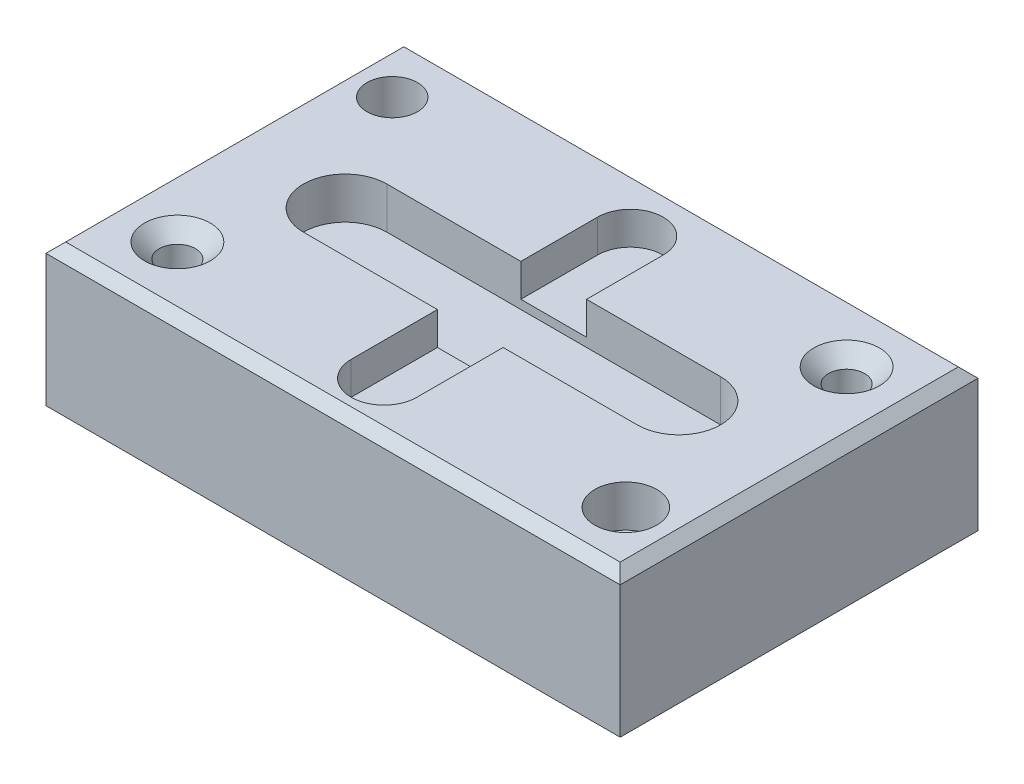
ISO-10303-21;
HEADER;
FILE_DESCRIPTION(('STEP AP214'),'2;1');
FILE_NAME('part.step','',(''),(''),'','','');
FILE_SCHEMA(('AUTOMOTIVE_DESIGN { 1 0 10303 214 1 1 1 1 }'));
ENDSEC;
DATA;
#1=APPLICATION_CONTEXT('core data for automotive mechanical design processes');
#2=APPLICATION_PROTOCOL_DEFINITION('international standard','automotive_design',2000,#1);
#3=PRODUCT_CONTEXT('',#1,'mechanical');
#4=PRODUCT('Part','Part','',(#3));
#5=PRODUCT_RELATED_PRODUCT_CATEGORY('part','',(#4));
#6=PRODUCT_DEFINITION_FORMATION('','',#4);
#7=PRODUCT_DEFINITION_CONTEXT('part definition',#1,'design');
#8=PRODUCT_DEFINITION('design','',#6,#7);
#9=PRODUCT_DEFINITION_SHAPE('','',#8);
#10=(LENGTH_UNIT() NAMED_UNIT(*) SI_UNIT(.MILLI.,.METRE.));
#11=(NAMED_UNIT(*) PLANE_ANGLE_UNIT() SI_UNIT($,.RADIAN.));
#12=(NAMED_UNIT(*) SI_UNIT($,.STERADIAN.) SOLID_ANGLE_UNIT());
#13=UNCERTAINTY_MEASURE_WITH_UNIT(LENGTH_MEASURE(1.E-05),#10,'distance_accuracy_value','');
#14=(GEOMETRIC_REPRESENTATION_CONTEXT(3) GLOBAL_UNCERTAINTY_ASSIGNED_CONTEXT((#13)) GLOBAL_UNIT_ASSIGNED_CONTEXT((#10,
#11,#12)) REPRESENTATION_CONTEXT('',''));
#15=CARTESIAN_POINT('',(0.,0.,0.));
#16=DIRECTION('',(0.,0.,1.));
#17=DIRECTION('',(1.,0.,0.));
#18=AXIS2_PLACEMENT_3D('',#15,#16,#17);
#19=CARTESIAN_POINT('',(87.39808345323,43.18,54.4636150551653));
#20=DIRECTION('',(-1.,0.,0.));
#21=DIRECTION('',(0.,0.,1.));
#22=AXIS2_PLACEMENT_3D('',#19,#20,#21);
#23=PLANE('',#22);
#24=DIRECTION('',(0.,-1.,0.));
#25=VECTOR('',#24,1.);
#26=CARTESIAN_POINT('',(87.39808345323,43.18,-54.4636150551653));
#27=LINE('',#26,#25);
#28=CARTESIAN_POINT('',(87.39808345323,40.18,-54.4636150551653));
#29=VERTEX_POINT('',#28);
#30=CARTESIAN_POINT('',(87.39808345323,0.,-54.4636150551653));
#31=VERTEX_POINT('',#30);
#32=EDGE_CURVE('E542',#29,#31,#27,.T.);
#33=ORIENTED_EDGE('',*,*,#32,.F.);
#34=DIRECTION('',(0.,0.,1.));
#35=VECTOR('',#34,1.);
#36=CARTESIAN_POINT('',(87.39808345323,40.18,54.4636150551653));
#37=LINE('',#36,#35);
#38=CARTESIAN_POINT('',(87.39808345323,40.18,54.4636150551653));
#39=VERTEX_POINT('',#38);
#40=EDGE_CURVE('E61',#29,#39,#37,.T.);
#41=ORIENTED_EDGE('',*,*,#40,.T.);
#42=DIRECTION('',(0.,-1.,0.));
#43=VECTOR('',#42,1.);
#44=CARTESIAN_POINT('',(87.39808345323,43.18,54.4636150551653));
#45=LINE('',#44,#43);
#46=CARTESIAN_POINT('',(87.39808345323,0.,54.4636150551653));
#47=VERTEX_POINT('',#46);
#48=EDGE_CURVE('E529',#39,#47,#45,.T.);
#49=ORIENTED_EDGE('',*,*,#48,.T.);
#50=DIRECTION('',(0.,0.,-1.));
#51=VECTOR('',#50,1.);
#52=CARTESIAN_POINT('',(87.39808345323,0.,54.4636150551653));
#53=LINE('',#52,#51);
#54=EDGE_CURVE('E360',#47,#31,#53,.T.);
#55=ORIENTED_EDGE('',*,*,#54,.T.);
#56=EDGE_LOOP('',(#33,#41,#49,#55));
#57=FACE_BOUND('',#56,.T.);
#58=ADVANCED_FACE('F50',(#57),#23,.F.);
#59=CARTESIAN_POINT('',(-87.39808345323,43.18,-54.4636150551653));
#60=DIRECTION('',(0.,0.,1.));
#61=DIRECTION('',(1.,0.,0.));
#62=AXIS2_PLACEMENT_3D('',#59,#60,#61);
#63=PLANE('',#62);
#64=DIRECTION('',(0.,-1.,0.));
#65=VECTOR('',#64,1.);
#66=CARTESIAN_POINT('',(-87.39808345323,43.18,-54.4636150551653));
#67=LINE('',#66,#65);
#68=CARTESIAN_POINT('',(-87.39808345323,40.18,-54.4636150551653));
#69=VERTEX_POINT('',#68);
#70=CARTESIAN_POINT('',(-87.39808345323,0.,-54.4636150551653));
#71=VERTEX_POINT('',#70);
#72=EDGE_CURVE('E536',#69,#71,#67,.T.);
#73=ORIENTED_EDGE('',*,*,#72,.F.);
#74=DIRECTION('',(1.,0.,0.));
#75=VECTOR('',#74,1.);
#76=CARTESIAN_POINT('',(-87.39808345323,40.18,-54.4636150551653));
#77=LINE('',#76,#75);
#78=EDGE_CURVE('E12',#69,#29,#77,.T.);
#79=ORIENTED_EDGE('',*,*,#78,.T.);
#80=ORIENTED_EDGE('',*,*,#32,.T.);
#81=DIRECTION('',(-1.,0.,0.));
#82=VECTOR('',#81,1.);
#83=CARTESIAN_POINT('',(-87.39808345323,0.,-54.4636150551653));
#84=LINE('',#83,#82);
#85=EDGE_CURVE('E594',#31,#71,#84,.T.);
#86=ORIENTED_EDGE('',*,*,#85,.T.);
#87=EDGE_LOOP('',(#73,#79,#80,#86));
#88=FACE_BOUND('',#87,.T.);
#89=ADVANCED_FACE('F487',(#88),#63,.F.);
#90=CARTESIAN_POINT('',(-87.39808345323,43.18,54.4636150551653));
#91=DIRECTION('',(1.,0.,0.));
#92=DIRECTION('',(0.,0.,-1.));
#93=AXIS2_PLACEMENT_3D('',#90,#91,#92);
#94=PLANE('',#93);
#95=DIRECTION('',(0.,-1.,0.));
#96=VECTOR('',#95,1.);
#97=CARTESIAN_POINT('',(-87.39808345323,43.18,54.4636150551653));
#98=LINE('',#97,#96);
#99=CARTESIAN_POINT('',(-87.39808345323,40.18,54.4636150551653));
#100=VERTEX_POINT('',#99);
#101=CARTESIAN_POINT('',(-87.39808345323,0.,54.4636150551653));
#102=VERTEX_POINT('',#101);
#103=EDGE_CURVE('E527',#100,#102,#98,.T.);
#104=ORIENTED_EDGE('',*,*,#103,.F.);
#105=DIRECTION('',(0.,0.,-1.));
#106=VECTOR('',#105,1.);
#107=CARTESIAN_POINT('',(-87.39808345323,40.18,54.4636150551653));
#108=LINE('',#107,#106);
#109=EDGE_CURVE('E397',#100,#69,#108,.T.);
#110=ORIENTED_EDGE('',*,*,#109,.T.);
#111=ORIENTED_EDGE('',*,*,#72,.T.);
#112=DIRECTION('',(0.,0.,1.));
#113=VECTOR('',#112,1.);
#114=CARTESIAN_POINT('',(-87.39808345323,0.,54.4636150551653));
#115=LINE('',#114,#113);
#116=EDGE_CURVE('E533',#71,#102,#115,.T.);
#117=ORIENTED_EDGE('',*,*,#116,.T.);
#118=EDGE_LOOP('',(#104,#110,#111,#117));
#119=FACE_BOUND('',#118,.T.);
#120=ADVANCED_FACE('F492',(#119),#94,.F.);
#121=CARTESIAN_POINT('',(-87.39808345323,43.18,54.4636150551653));
#122=DIRECTION('',(0.,0.,-1.));
#123=DIRECTION('',(-1.,0.,0.));
#124=AXIS2_PLACEMENT_3D('',#121,#122,#123);
#125=PLANE('',#124);
#126=ORIENTED_EDGE('',*,*,#48,.F.);
#127=DIRECTION('',(-1.,0.,0.));
#128=VECTOR('',#127,1.);
#129=CARTESIAN_POINT('',(-87.39808345323,40.18,54.4636150551653));
#130=LINE('',#129,#128);
#131=EDGE_CURVE('E401',#39,#100,#130,.T.);
#132=ORIENTED_EDGE('',*,*,#131,.T.);
#133=ORIENTED_EDGE('',*,*,#103,.T.);
#134=DIRECTION('',(1.,0.,0.));
#135=VECTOR('',#134,1.);
#136=CARTESIAN_POINT('',(-87.39808345323,0.,54.4636150551653));
#137=LINE('',#136,#135);
#138=EDGE_CURVE('E544',#102,#47,#137,.T.);
#139=ORIENTED_EDGE('',*,*,#138,.T.);
#140=EDGE_LOOP('',(#126,#132,#133,#139));
#141=FACE_BOUND('',#140,.T.);
#142=ADVANCED_FACE('F433',(#141),#125,.F.);
#143=CARTESIAN_POINT('',(0.,43.18,0.));
#144=DIRECTION('',(0.,-1.,0.));
#145=DIRECTION('',(0.,0.,-1.));
#146=AXIS2_PLACEMENT_3D('',#143,#144,#145);
#147=PLANE('',#146);
#148=DIRECTION('',(-1.,0.,0.));
#149=VECTOR('',#148,1.);
#150=CARTESIAN_POINT('',(0.,43.18,-51.4636150551654));
#151=LINE('',#150,#149);
#152=CARTESIAN_POINT('',(84.39808345323,43.18,-51.4636150551654));
#153=VERTEX_POINT('',#152);
#154=CARTESIAN_POINT('',(-84.39808345323,43.18,-51.4636150551654));
#155=VERTEX_POINT('',#154);
#156=EDGE_CURVE('E382',#153,#155,#151,.T.);
#157=ORIENTED_EDGE('',*,*,#156,.T.);
#158=DIRECTION('',(0.,0.,1.));
#159=VECTOR('',#158,1.);
#160=CARTESIAN_POINT('',(-84.39808345323,43.18,0.));
#161=LINE('',#160,#159);
#162=CARTESIAN_POINT('',(-84.39808345323,43.18,51.4636150551654));
#163=VERTEX_POINT('',#162);
#164=EDGE_CURVE('E393',#155,#163,#161,.T.);
#165=ORIENTED_EDGE('',*,*,#164,.T.);
#166=DIRECTION('',(1.,0.,0.));
#167=VECTOR('',#166,1.);
#168=CARTESIAN_POINT('',(0.,43.18,51.4636150551654));
#169=LINE('',#168,#167);
#170=CARTESIAN_POINT('',(84.39808345323,43.18,51.4636150551654));
#171=VERTEX_POINT('',#170);
#172=EDGE_CURVE('E390',#163,#171,#169,.T.);
#173=ORIENTED_EDGE('',*,*,#172,.T.);
#174=DIRECTION('',(0.,0.,-1.));
#175=VECTOR('',#174,1.);
#176=CARTESIAN_POINT('',(84.39808345323,43.18,0.));
#177=LINE('',#176,#175);
#178=EDGE_CURVE('E387',#171,#153,#177,.T.);
#179=ORIENTED_EDGE('',*,*,#178,.T.);
#180=EDGE_LOOP('',(#157,#165,#173,#179));
#181=FACE_BOUND('',#180,.T.);
#182=CARTESIAN_POINT('',(67.39808345323,43.18,-34.4636150551653));
#183=DIRECTION('',(0.,1.,0.));
#184=DIRECTION('',(0.,0.,1.));
#185=AXIS2_PLACEMENT_3D('',#182,#183,#184);
#186=CIRCLE('',#185,9.99999999999999);
#187=CARTESIAN_POINT('',(67.39808345323,43.18,-24.4636150551653));
#188=VERTEX_POINT('',#187);
#189=EDGE_CURVE('E201',#188,#188,#186,.T.);
#190=ORIENTED_EDGE('',*,*,#189,.F.);
#191=EDGE_LOOP('',(#190));
#192=FACE_BOUND('',#191,.T.);
#193=CARTESIAN_POINT('',(-67.39808345323,43.18,34.4636150551653));
#194=DIRECTION('',(0.,1.,0.));
#195=DIRECTION('',(0.,0.,1.));
#196=AXIS2_PLACEMENT_3D('',#193,#194,#195);
#197=CIRCLE('',#196,10.);
#198=CARTESIAN_POINT('',(-67.39808345323,43.18,44.4636150551653));
#199=VERTEX_POINT('',#198);
#200=EDGE_CURVE('E192',#199,#199,#197,.T.);
#201=ORIENTED_EDGE('',*,*,#200,.F.);
#202=EDGE_LOOP('',(#201));
#203=FACE_BOUND('',#202,.T.);
#204=CARTESIAN_POINT('',(70.8012631762642,43.18,36.1578333525472));
#205=DIRECTION('',(0.,1.,0.));
#206=DIRECTION('',(0.,0.,1.));
#207=AXIS2_PLACEMENT_3D('',#204,#205,#206);
#208=CIRCLE('',#207,9.43080752369951);
#209=CARTESIAN_POINT('',(70.8012631762642,43.18,45.5886408762467));
#210=VERTEX_POINT('',#209);
#211=EDGE_CURVE('E339',#210,#210,#208,.T.);
#212=ORIENTED_EDGE('',*,*,#211,.F.);
#213=EDGE_LOOP('',(#212));
#214=FACE_BOUND('',#213,.T.);
#215=CARTESIAN_POINT('',(-72.8740366318448,43.18,-36.4086310498237));
#216=DIRECTION('',(0.,1.,0.));
#217=DIRECTION('',(0.,0.,1.));
#218=AXIS2_PLACEMENT_3D('',#215,#216,#217);
#219=CIRCLE('',#218,7.69741318755806);
#220=CARTESIAN_POINT('',(-72.8740366318448,43.18,-28.7112178622657));
#221=VERTEX_POINT('',#220);
#222=EDGE_CURVE('E444',#221,#221,#219,.T.);
#223=ORIENTED_EDGE('',*,*,#222,.F.);
#224=EDGE_LOOP('',(#223));
#225=FACE_BOUND('',#224,.T.);
#226=DIRECTION('',(1.,0.,0.));
#227=VECTOR('',#226,1.);
#228=CARTESIAN_POINT('',(-50.8,43.18,12.7));
#229=LINE('',#228,#227);
#230=CARTESIAN_POINT('',(9.99999999999998,43.18,12.7));
#231=VERTEX_POINT('',#230);
#232=CARTESIAN_POINT('',(50.8,43.18,12.7));
#233=VERTEX_POINT('',#232);
#234=EDGE_CURVE('E277',#231,#233,#229,.T.);
#235=ORIENTED_EDGE('',*,*,#234,.F.);
#236=DIRECTION('',(0.,0.,-1.));
#237=VECTOR('',#236,1.);
#238=CARTESIAN_POINT('',(9.99999999999998,43.18,-36.0363849448347));
#239=LINE('',#238,#237);
#240=CARTESIAN_POINT('',(9.99999999999997,43.18,38.9636150551653));
#241=VERTEX_POINT('',#240);
#242=EDGE_CURVE('E219',#241,#231,#239,.T.);
#243=ORIENTED_EDGE('',*,*,#242,.F.);
#244=CARTESIAN_POINT('',(0.,43.18,38.9636150551653));
#245=DIRECTION('',(0.,1.,0.));
#246=DIRECTION('',(0.,0.,1.));
#247=AXIS2_PLACEMENT_3D('',#244,#245,#246);
#248=CIRCLE('',#247,9.99999999999996);
#249=CARTESIAN_POINT('',(-9.99999999999998,43.18,38.9636150551653));
#250=VERTEX_POINT('',#249);
#251=EDGE_CURVE('E259',#250,#241,#248,.T.);
#252=ORIENTED_EDGE('',*,*,#251,.F.);
#253=DIRECTION('',(0.,0.,1.));
#254=VECTOR('',#253,1.);
#255=CARTESIAN_POINT('',(-9.99999999999994,43.18,-36.0363849448347));
#256=LINE('',#255,#254);
#257=CARTESIAN_POINT('',(-9.99999999999995,43.18,12.7));
#258=VERTEX_POINT('',#257);
#259=EDGE_CURVE('E243',#258,#250,#256,.T.);
#260=ORIENTED_EDGE('',*,*,#259,.F.);
#261=CARTESIAN_POINT('',(-50.8,43.18,12.7));
#262=VERTEX_POINT('',#261);
#263=EDGE_CURVE('E270',#262,#258,#229,.T.);
#264=ORIENTED_EDGE('',*,*,#263,.F.);
#265=CARTESIAN_POINT('',(-50.8,43.18,0.));
#266=DIRECTION('',(0.,1.,0.));
#267=DIRECTION('',(0.,0.,1.));
#268=AXIS2_PLACEMENT_3D('',#265,#266,#267);
#269=CIRCLE('',#268,12.7);
#270=CARTESIAN_POINT('',(-50.8,43.18,-12.7));
#271=VERTEX_POINT('',#270);
#272=EDGE_CURVE('E278',#271,#262,#269,.T.);
#273=ORIENTED_EDGE('',*,*,#272,.F.);
#274=DIRECTION('',(-1.,0.,0.));
#275=VECTOR('',#274,1.);
#276=CARTESIAN_POINT('',(-50.8,43.18,-12.7));
#277=LINE('',#276,#275);
#278=CARTESIAN_POINT('',(-9.99999999999994,43.18,-12.7));
#279=VERTEX_POINT('',#278);
#280=EDGE_CURVE('E285',#279,#271,#277,.T.);
#281=ORIENTED_EDGE('',*,*,#280,.F.);
#282=CARTESIAN_POINT('',(-9.99999999999994,43.18,-36.0363849448347));
#283=VERTEX_POINT('',#282);
#284=EDGE_CURVE('E244',#283,#279,#256,.T.);
#285=ORIENTED_EDGE('',*,*,#284,.F.);
#286=CARTESIAN_POINT('',(0.,43.18,-36.0363849448347));
#287=DIRECTION('',(0.,1.,0.));
#288=DIRECTION('',(0.,0.,1.));
#289=AXIS2_PLACEMENT_3D('',#286,#287,#288);
#290=CIRCLE('',#289,9.99999999999996);
#291=CARTESIAN_POINT('',(9.99999999999998,43.18,-36.0363849448347));
#292=VERTEX_POINT('',#291);
#293=EDGE_CURVE('E212',#292,#283,#290,.T.);
#294=ORIENTED_EDGE('',*,*,#293,.F.);
#295=CARTESIAN_POINT('',(9.99999999999998,43.18,-12.7));
#296=VERTEX_POINT('',#295);
#297=EDGE_CURVE('E258',#296,#292,#239,.T.);
#298=ORIENTED_EDGE('',*,*,#297,.F.);
#299=CARTESIAN_POINT('',(50.8,43.18,-12.7));
#300=VERTEX_POINT('',#299);
#301=EDGE_CURVE('E286',#300,#296,#277,.T.);
#302=ORIENTED_EDGE('',*,*,#301,.F.);
#303=CARTESIAN_POINT('',(50.8,43.18,0.));
#304=DIRECTION('',(0.,1.,0.));
#305=DIRECTION('',(0.,0.,1.));
#306=AXIS2_PLACEMENT_3D('',#303,#304,#305);
#307=CIRCLE('',#306,12.7);
#308=EDGE_CURVE('E276',#233,#300,#307,.T.);
#309=ORIENTED_EDGE('',*,*,#308,.F.);
#310=EDGE_LOOP('',(#235,#243,#252,#260,#264,#273,#281,#285,#294,#298,#302,#309));
#311=FACE_BOUND('',#310,.T.);
#312=ADVANCED_FACE('F429',(#181,#192,#203,#214,#225,#311),#147,.F.);
#313=CARTESIAN_POINT('',(0.,0.,0.));
#314=DIRECTION('',(0.,-1.,0.));
#315=DIRECTION('',(0.,0.,-1.));
#316=AXIS2_PLACEMENT_3D('',#313,#314,#315);
#317=PLANE('',#316);
#318=ORIENTED_EDGE('',*,*,#54,.F.);
#319=ORIENTED_EDGE('',*,*,#138,.F.);
#320=ORIENTED_EDGE('',*,*,#116,.F.);
#321=ORIENTED_EDGE('',*,*,#85,.F.);
#322=EDGE_LOOP('',(#318,#319,#320,#321));
#323=FACE_BOUND('',#322,.T.);
#324=ADVANCED_FACE('F432',(#323),#317,.T.);
#325=CARTESIAN_POINT('',(-50.8,30.48,0.));
#326=DIRECTION('',(0.,1.,0.));
#327=DIRECTION('',(0.,0.,1.));
#328=AXIS2_PLACEMENT_3D('',#325,#326,#327);
#329=CYLINDRICAL_SURFACE('',#328,12.7);
#330=ORIENTED_EDGE('',*,*,#272,.T.);
#331=DIRECTION('',(0.,1.,0.));
#332=VECTOR('',#331,1.);
#333=CARTESIAN_POINT('',(-50.8,30.48,12.7));
#334=LINE('',#333,#332);
#335=CARTESIAN_POINT('',(-50.8,30.48,12.7));
#336=VERTEX_POINT('',#335);
#337=EDGE_CURVE('E305',#336,#262,#334,.T.);
#338=ORIENTED_EDGE('',*,*,#337,.F.);
#339=CARTESIAN_POINT('',(-50.8,30.48,0.));
#340=DIRECTION('',(0.,1.,0.));
#341=DIRECTION('',(0.,0.,1.));
#342=AXIS2_PLACEMENT_3D('',#339,#340,#341);
#343=CIRCLE('',#342,12.7);
#344=CARTESIAN_POINT('',(-50.8,30.48,-12.7));
#345=VERTEX_POINT('',#344);
#346=EDGE_CURVE('E291',#345,#336,#343,.T.);
#347=ORIENTED_EDGE('',*,*,#346,.F.);
#348=DIRECTION('',(0.,1.,0.));
#349=VECTOR('',#348,1.);
#350=CARTESIAN_POINT('',(-50.8,30.48,-12.7));
#351=LINE('',#350,#349);
#352=EDGE_CURVE('E292',#345,#271,#351,.T.);
#353=ORIENTED_EDGE('',*,*,#352,.T.);
#354=EDGE_LOOP('',(#330,#338,#347,#353));
#355=FACE_BOUND('',#354,.T.);
#356=ADVANCED_FACE('F589',(#355),#329,.F.);
#357=CARTESIAN_POINT('',(-50.8,30.48,-12.7));
#358=DIRECTION('',(0.,0.,-1.));
#359=DIRECTION('',(-1.,0.,0.));
#360=AXIS2_PLACEMENT_3D('',#357,#358,#359);
#361=PLANE('',#360);
#362=ORIENTED_EDGE('',*,*,#301,.T.);
#363=DIRECTION('',(0.,-1.,0.));
#364=VECTOR('',#363,1.);
#365=CARTESIAN_POINT('',(9.99999999999997,30.48,-12.7));
#366=LINE('',#365,#364);
#367=CARTESIAN_POINT('',(9.99999999999998,33.18,-12.7));
#368=VERTEX_POINT('',#367);
#369=EDGE_CURVE('E334',#296,#368,#366,.T.);
#370=ORIENTED_EDGE('',*,*,#369,.T.);
#371=DIRECTION('',(1.,0.,0.));
#372=VECTOR('',#371,1.);
#373=CARTESIAN_POINT('',(-50.8,33.18,-12.7));
#374=LINE('',#373,#372);
#375=CARTESIAN_POINT('',(-9.99999999999997,33.18,-12.7));
#376=VERTEX_POINT('',#375);
#377=EDGE_CURVE('E323',#376,#368,#374,.T.);
#378=ORIENTED_EDGE('',*,*,#377,.F.);
#379=DIRECTION('',(0.,1.,0.));
#380=VECTOR('',#379,1.);
#381=CARTESIAN_POINT('',(-9.99999999999995,30.48,-12.7));
#382=LINE('',#381,#380);
#383=EDGE_CURVE('E327',#376,#279,#382,.T.);
#384=ORIENTED_EDGE('',*,*,#383,.T.);
#385=ORIENTED_EDGE('',*,*,#280,.T.);
#386=ORIENTED_EDGE('',*,*,#352,.F.);
#387=DIRECTION('',(-1.,0.,0.));
#388=VECTOR('',#387,1.);
#389=CARTESIAN_POINT('',(-50.8,30.48,-12.7));
#390=LINE('',#389,#388);
#391=CARTESIAN_POINT('',(50.8,30.48,-12.7));
#392=VERTEX_POINT('',#391);
#393=EDGE_CURVE('E301',#392,#345,#390,.T.);
#394=ORIENTED_EDGE('',*,*,#393,.F.);
#395=DIRECTION('',(0.,1.,0.));
#396=VECTOR('',#395,1.);
#397=CARTESIAN_POINT('',(50.8,30.48,-12.7));
#398=LINE('',#397,#396);
#399=EDGE_CURVE('E348',#392,#300,#398,.T.);
#400=ORIENTED_EDGE('',*,*,#399,.T.);
#401=EDGE_LOOP('',(#362,#370,#378,#384,#385,#386,#394,#400));
#402=FACE_BOUND('',#401,.T.);
#403=ADVANCED_FACE('F585',(#402),#361,.F.);
#404=CARTESIAN_POINT('',(50.8,30.48,0.));
#405=DIRECTION('',(0.,1.,0.));
#406=DIRECTION('',(0.,0.,1.));
#407=AXIS2_PLACEMENT_3D('',#404,#405,#406);
#408=CYLINDRICAL_SURFACE('',#407,12.7);
#409=ORIENTED_EDGE('',*,*,#308,.T.);
#410=ORIENTED_EDGE('',*,*,#399,.F.);
#411=CARTESIAN_POINT('',(50.8,30.48,0.));
#412=DIRECTION('',(0.,1.,0.));
#413=DIRECTION('',(0.,0.,1.));
#414=AXIS2_PLACEMENT_3D('',#411,#412,#413);
#415=CIRCLE('',#414,12.7);
#416=CARTESIAN_POINT('',(50.8,30.48,12.7));
#417=VERTEX_POINT('',#416);
#418=EDGE_CURVE('E306',#417,#392,#415,.T.);
#419=ORIENTED_EDGE('',*,*,#418,.F.);
#420=DIRECTION('',(0.,1.,0.));
#421=VECTOR('',#420,1.);
#422=CARTESIAN_POINT('',(50.8,30.48,12.7));
#423=LINE('',#422,#421);
#424=EDGE_CURVE('E351',#417,#233,#423,.T.);
#425=ORIENTED_EDGE('',*,*,#424,.T.);
#426=EDGE_LOOP('',(#409,#410,#419,#425));
#427=FACE_BOUND('',#426,.T.);
#428=ADVANCED_FACE('F640',(#427),#408,.F.);
#429=CARTESIAN_POINT('',(-50.8,30.48,12.7));
#430=DIRECTION('',(0.,0.,1.));
#431=DIRECTION('',(1.,0.,0.));
#432=AXIS2_PLACEMENT_3D('',#429,#430,#431);
#433=PLANE('',#432);
#434=DIRECTION('',(-1.,0.,0.));
#435=VECTOR('',#434,1.);
#436=CARTESIAN_POINT('',(-50.8,33.18,12.7));
#437=LINE('',#436,#435);
#438=CARTESIAN_POINT('',(9.99999999999998,33.18,12.7));
#439=VERTEX_POINT('',#438);
#440=CARTESIAN_POINT('',(-9.99999999999995,33.18,12.7));
#441=VERTEX_POINT('',#440);
#442=EDGE_CURVE('E549',#439,#441,#437,.T.);
#443=ORIENTED_EDGE('',*,*,#442,.F.);
#444=DIRECTION('',(0.,1.,0.));
#445=VECTOR('',#444,1.);
#446=CARTESIAN_POINT('',(9.99999999999997,30.48,12.7));
#447=LINE('',#446,#445);
#448=EDGE_CURVE('E377',#439,#231,#447,.T.);
#449=ORIENTED_EDGE('',*,*,#448,.T.);
#450=ORIENTED_EDGE('',*,*,#234,.T.);
#451=ORIENTED_EDGE('',*,*,#424,.F.);
#452=DIRECTION('',(1.,0.,0.));
#453=VECTOR('',#452,1.);
#454=CARTESIAN_POINT('',(-50.8,30.48,12.7));
#455=LINE('',#454,#453);
#456=EDGE_CURVE('E311',#336,#417,#455,.T.);
#457=ORIENTED_EDGE('',*,*,#456,.F.);
#458=ORIENTED_EDGE('',*,*,#337,.T.);
#459=ORIENTED_EDGE('',*,*,#263,.T.);
#460=DIRECTION('',(0.,-1.,0.));
#461=VECTOR('',#460,1.);
#462=CARTESIAN_POINT('',(-9.99999999999995,30.48,12.7));
#463=LINE('',#462,#461);
#464=EDGE_CURVE('E383',#258,#441,#463,.T.);
#465=ORIENTED_EDGE('',*,*,#464,.T.);
#466=EDGE_LOOP('',(#443,#449,#450,#451,#457,#458,#459,#465));
#467=FACE_BOUND('',#466,.T.);
#468=ADVANCED_FACE('F557',(#467),#433,.F.);
#469=CARTESIAN_POINT('',(-50.8,30.48,0.));
#470=DIRECTION('',(0.,1.,0.));
#471=DIRECTION('',(0.,0.,1.));
#472=AXIS2_PLACEMENT_3D('',#469,#470,#471);
#473=PLANE('',#472);
#474=ORIENTED_EDGE('',*,*,#346,.T.);
#475=ORIENTED_EDGE('',*,*,#456,.T.);
#476=ORIENTED_EDGE('',*,*,#418,.T.);
#477=ORIENTED_EDGE('',*,*,#393,.T.);
#478=EDGE_LOOP('',(#474,#475,#476,#477));
#479=FACE_BOUND('',#478,.T.);
#480=ADVANCED_FACE('F657',(#479),#473,.T.);
#481=CARTESIAN_POINT('',(-72.8740366318448,30.48,-36.4086310498237));
#482=DIRECTION('',(0.,1.,0.));
#483=DIRECTION('',(0.,0.,1.));
#484=AXIS2_PLACEMENT_3D('',#481,#482,#483);
#485=CYLINDRICAL_SURFACE('',#484,7.69741318755806);
#486=CARTESIAN_POINT('',(-72.8740366318448,30.48,-36.4086310498237));
#487=DIRECTION('',(0.,1.,0.));
#488=DIRECTION('',(0.,0.,1.));
#489=AXIS2_PLACEMENT_3D('',#486,#487,#488);
#490=CIRCLE('',#489,7.69741318755806);
#491=CARTESIAN_POINT('',(-72.8740366318448,30.48,-28.7112178622657));
#492=VERTEX_POINT('',#491);
#493=EDGE_CURVE('E340',#492,#492,#490,.T.);
#494=ORIENTED_EDGE('',*,*,#493,.F.);
#495=EDGE_LOOP('',(#494));
#496=FACE_BOUND('',#495,.T.);
#497=ORIENTED_EDGE('',*,*,#222,.T.);
#498=EDGE_LOOP('',(#497));
#499=FACE_BOUND('',#498,.T.);
#500=ADVANCED_FACE('F482',(#496,#499),#485,.F.);
#501=CARTESIAN_POINT('',(-72.8740366318448,30.48,-36.4086310498237));
#502=DIRECTION('',(0.,1.,0.));
#503=DIRECTION('',(0.,0.,1.));
#504=AXIS2_PLACEMENT_3D('',#501,#502,#503);
#505=PLANE('',#504);
#506=ORIENTED_EDGE('',*,*,#493,.T.);
#507=EDGE_LOOP('',(#506));
#508=FACE_BOUND('',#507,.T.);
#509=ADVANCED_FACE('F472',(#508),#505,.T.);
#510=CARTESIAN_POINT('',(70.8012631762642,30.48,36.1578333525472));
#511=DIRECTION('',(0.,1.,0.));
#512=DIRECTION('',(0.,0.,1.));
#513=AXIS2_PLACEMENT_3D('',#510,#511,#512);
#514=CYLINDRICAL_SURFACE('',#513,9.43080752369951);
#515=CARTESIAN_POINT('',(70.8012631762642,30.48,36.1578333525472));
#516=DIRECTION('',(0.,1.,0.));
#517=DIRECTION('',(0.,0.,1.));
#518=AXIS2_PLACEMENT_3D('',#515,#516,#517);
#519=CIRCLE('',#518,9.43080752369951);
#520=CARTESIAN_POINT('',(70.8012631762642,30.48,45.5886408762467));
#521=VERTEX_POINT('',#520);
#522=EDGE_CURVE('E462',#521,#521,#519,.T.);
#523=ORIENTED_EDGE('',*,*,#522,.F.);
#524=EDGE_LOOP('',(#523));
#525=FACE_BOUND('',#524,.T.);
#526=ORIENTED_EDGE('',*,*,#211,.T.);
#527=EDGE_LOOP('',(#526));
#528=FACE_BOUND('',#527,.T.);
#529=ADVANCED_FACE('F469',(#525,#528),#514,.F.);
#530=CARTESIAN_POINT('',(70.8012631762642,30.48,36.1578333525472));
#531=DIRECTION('',(0.,1.,0.));
#532=DIRECTION('',(0.,0.,1.));
#533=AXIS2_PLACEMENT_3D('',#530,#531,#532);
#534=PLANE('',#533);
#535=ORIENTED_EDGE('',*,*,#522,.T.);
#536=EDGE_LOOP('',(#535));
#537=FACE_BOUND('',#536,.T.);
#538=ADVANCED_FACE('F471',(#537),#534,.T.);
#539=CARTESIAN_POINT('',(0.,33.18,-36.0363849448347));
#540=DIRECTION('',(0.,1.,0.));
#541=DIRECTION('',(0.,0.,1.));
#542=AXIS2_PLACEMENT_3D('',#539,#540,#541);
#543=PLANE('',#542);
#544=ORIENTED_EDGE('',*,*,#442,.T.);
#545=DIRECTION('',(0.,0.,1.));
#546=VECTOR('',#545,1.);
#547=CARTESIAN_POINT('',(-9.99999999999994,33.18,-36.0363849448347));
#548=LINE('',#547,#546);
#549=CARTESIAN_POINT('',(-9.99999999999998,33.18,38.9636150551653));
#550=VERTEX_POINT('',#549);
#551=EDGE_CURVE('E218',#441,#550,#548,.T.);
#552=ORIENTED_EDGE('',*,*,#551,.T.);
#553=CARTESIAN_POINT('',(0.,33.18,38.9636150551653));
#554=DIRECTION('',(0.,1.,0.));
#555=DIRECTION('',(0.,0.,1.));
#556=AXIS2_PLACEMENT_3D('',#553,#554,#555);
#557=CIRCLE('',#556,9.99999999999996);
#558=CARTESIAN_POINT('',(9.99999999999997,33.18,38.9636150551653));
#559=VERTEX_POINT('',#558);
#560=EDGE_CURVE('E236',#550,#559,#557,.T.);
#561=ORIENTED_EDGE('',*,*,#560,.T.);
#562=DIRECTION('',(0.,0.,-1.));
#563=VECTOR('',#562,1.);
#564=CARTESIAN_POINT('',(9.99999999999998,33.18,-36.0363849448347));
#565=LINE('',#564,#563);
#566=EDGE_CURVE('E230',#559,#439,#565,.T.);
#567=ORIENTED_EDGE('',*,*,#566,.T.);
#568=EDGE_LOOP('',(#544,#552,#561,#567));
#569=FACE_BOUND('',#568,.T.);
#570=ADVANCED_FACE('F479',(#569),#543,.T.);
#571=CARTESIAN_POINT('',(-9.99999999999994,33.18,-36.0363849448347));
#572=DIRECTION('',(-1.,0.,0.));
#573=DIRECTION('',(0.,0.,1.));
#574=AXIS2_PLACEMENT_3D('',#571,#572,#573);
#575=PLANE('',#574);
#576=ORIENTED_EDGE('',*,*,#259,.T.);
#577=DIRECTION('',(0.,1.,0.));
#578=VECTOR('',#577,1.);
#579=CARTESIAN_POINT('',(-9.99999999999998,33.18,38.9636150551653));
#580=LINE('',#579,#578);
#581=EDGE_CURVE('E369',#550,#250,#580,.T.);
#582=ORIENTED_EDGE('',*,*,#581,.F.);
#583=ORIENTED_EDGE('',*,*,#551,.F.);
#584=ORIENTED_EDGE('',*,*,#464,.F.);
#585=EDGE_LOOP('',(#576,#582,#583,#584));
#586=FACE_BOUND('',#585,.T.);
#587=ADVANCED_FACE('F561',(#586),#575,.F.);
#588=CARTESIAN_POINT('',(9.99999999999998,33.18,-36.0363849448347));
#589=DIRECTION('',(1.,0.,0.));
#590=DIRECTION('',(0.,0.,-1.));
#591=AXIS2_PLACEMENT_3D('',#588,#589,#590);
#592=PLANE('',#591);
#593=ORIENTED_EDGE('',*,*,#566,.F.);
#594=DIRECTION('',(0.,1.,0.));
#595=VECTOR('',#594,1.);
#596=CARTESIAN_POINT('',(9.99999999999997,33.18,38.9636150551653));
#597=LINE('',#596,#595);
#598=EDGE_CURVE('E373',#559,#241,#597,.T.);
#599=ORIENTED_EDGE('',*,*,#598,.T.);
#600=ORIENTED_EDGE('',*,*,#242,.T.);
#601=ORIENTED_EDGE('',*,*,#448,.F.);
#602=EDGE_LOOP('',(#593,#599,#600,#601));
#603=FACE_BOUND('',#602,.T.);
#604=ADVANCED_FACE('F701',(#603),#592,.F.);
#605=CARTESIAN_POINT('',(0.,33.18,38.9636150551653));
#606=DIRECTION('',(0.,1.,0.));
#607=DIRECTION('',(0.,0.,1.));
#608=AXIS2_PLACEMENT_3D('',#605,#606,#607);
#609=CYLINDRICAL_SURFACE('',#608,9.99999999999996);
#610=ORIENTED_EDGE('',*,*,#251,.T.);
#611=ORIENTED_EDGE('',*,*,#598,.F.);
#612=ORIENTED_EDGE('',*,*,#560,.F.);
#613=ORIENTED_EDGE('',*,*,#581,.T.);
#614=EDGE_LOOP('',(#610,#611,#612,#613));
#615=FACE_BOUND('',#614,.T.);
#616=ADVANCED_FACE('F712',(#615),#609,.F.);
#617=ORIENTED_EDGE('',*,*,#297,.T.);
#618=DIRECTION('',(0.,1.,0.));
#619=VECTOR('',#618,1.);
#620=CARTESIAN_POINT('',(9.99999999999998,33.18,-36.0363849448347));
#621=LINE('',#620,#619);
#622=CARTESIAN_POINT('',(9.99999999999998,33.18,-36.0363849448347));
#623=VERTEX_POINT('',#622);
#624=EDGE_CURVE('E261',#623,#292,#621,.T.);
#625=ORIENTED_EDGE('',*,*,#624,.F.);
#626=EDGE_CURVE('E235',#368,#623,#565,.T.);
#627=ORIENTED_EDGE('',*,*,#626,.F.);
#628=ORIENTED_EDGE('',*,*,#369,.F.);
#629=EDGE_LOOP('',(#617,#625,#627,#628));
#630=FACE_BOUND('',#629,.T.);
#631=ADVANCED_FACE('F576',(#630),#592,.F.);
#632=CARTESIAN_POINT('',(-9.99999999999994,33.18,-36.0363849448347));
#633=VERTEX_POINT('',#632);
#634=EDGE_CURVE('E220',#633,#376,#548,.T.);
#635=ORIENTED_EDGE('',*,*,#634,.F.);
#636=DIRECTION('',(0.,1.,0.));
#637=VECTOR('',#636,1.);
#638=CARTESIAN_POINT('',(-9.99999999999994,33.18,-36.0363849448347));
#639=LINE('',#638,#637);
#640=EDGE_CURVE('E234',#633,#283,#639,.T.);
#641=ORIENTED_EDGE('',*,*,#640,.T.);
#642=ORIENTED_EDGE('',*,*,#284,.T.);
#643=ORIENTED_EDGE('',*,*,#383,.F.);
#644=EDGE_LOOP('',(#635,#641,#642,#643));
#645=FACE_BOUND('',#644,.T.);
#646=ADVANCED_FACE('F703',(#645),#575,.F.);
#647=ORIENTED_EDGE('',*,*,#377,.T.);
#648=ORIENTED_EDGE('',*,*,#626,.T.);
#649=CARTESIAN_POINT('',(0.,33.18,-36.0363849448347));
#650=DIRECTION('',(0.,1.,0.));
#651=DIRECTION('',(0.,0.,1.));
#652=AXIS2_PLACEMENT_3D('',#649,#650,#651);
#653=CIRCLE('',#652,9.99999999999996);
#654=EDGE_CURVE('E213',#623,#633,#653,.T.);
#655=ORIENTED_EDGE('',*,*,#654,.T.);
#656=ORIENTED_EDGE('',*,*,#634,.T.);
#657=EDGE_LOOP('',(#647,#648,#655,#656));
#658=FACE_BOUND('',#657,.T.);
#659=ADVANCED_FACE('F692',(#658),#543,.T.);
#660=CARTESIAN_POINT('',(0.,33.18,-36.0363849448347));
#661=DIRECTION('',(0.,1.,0.));
#662=DIRECTION('',(0.,0.,1.));
#663=AXIS2_PLACEMENT_3D('',#660,#661,#662);
#664=CYLINDRICAL_SURFACE('',#663,9.99999999999996);
#665=ORIENTED_EDGE('',*,*,#293,.T.);
#666=ORIENTED_EDGE('',*,*,#640,.F.);
#667=ORIENTED_EDGE('',*,*,#654,.F.);
#668=ORIENTED_EDGE('',*,*,#624,.T.);
#669=EDGE_LOOP('',(#665,#666,#667,#668));
#670=FACE_BOUND('',#669,.T.);
#671=ADVANCED_FACE('F581',(#670),#664,.F.);
#672=CARTESIAN_POINT('',(-67.39808345323,26.4847334046516,34.4636150551653));
#673=DIRECTION('',(0.,1.,0.));
#674=DIRECTION('',(0.,0.,1.));
#675=AXIS2_PLACEMENT_3D('',#672,#673,#674);
#676=CONICAL_SURFACE('',#675,5.49999999999999,1.02974425867665);
#677=CARTESIAN_POINT('',(-67.39808345323,23.18,34.4636150551653));
#678=VERTEX_POINT('',#677);
#679=VERTEX_LOOP('',#678);
#680=FACE_BOUND('',#679,.T.);
#681=CARTESIAN_POINT('',(-67.39808345323,26.4847334046516,34.4636150551653));
#682=DIRECTION('',(0.,1.,0.));
#683=DIRECTION('',(0.,0.,1.));
#684=AXIS2_PLACEMENT_3D('',#681,#682,#683);
#685=CIRCLE('',#684,5.49999999999999);
#686=CARTESIAN_POINT('',(-67.39808345323,26.4847334046516,39.9636150551653));
#687=VERTEX_POINT('',#686);
#688=EDGE_CURVE('E208',#687,#687,#685,.T.);
#689=ORIENTED_EDGE('',*,*,#688,.T.);
#690=EDGE_LOOP('',(#689));
#691=FACE_BOUND('',#690,.T.);
#692=ADVANCED_FACE('F751',(#680,#691),#676,.F.);
#693=CARTESIAN_POINT('',(-67.39808345323,43.18,34.4636150551653));
#694=DIRECTION('',(0.,1.,0.));
#695=DIRECTION('',(0.,0.,1.));
#696=AXIS2_PLACEMENT_3D('',#693,#694,#695);
#697=CYLINDRICAL_SURFACE('',#696,5.49999999999999);
#698=ORIENTED_EDGE('',*,*,#688,.F.);
#699=EDGE_LOOP('',(#698));
#700=FACE_BOUND('',#699,.T.);
#701=CARTESIAN_POINT('',(-67.39808345323,38.68,34.4636150551653));
#702=DIRECTION('',(0.,1.,0.));
#703=DIRECTION('',(0.,0.,1.));
#704=AXIS2_PLACEMENT_3D('',#701,#702,#703);
#705=CIRCLE('',#704,5.5);
#706=CARTESIAN_POINT('',(-67.39808345323,38.68,39.9636150551653));
#707=VERTEX_POINT('',#706);
#708=EDGE_CURVE('E198',#707,#707,#705,.T.);
#709=ORIENTED_EDGE('',*,*,#708,.T.);
#710=EDGE_LOOP('',(#709));
#711=FACE_BOUND('',#710,.T.);
#712=ADVANCED_FACE('F760',(#700,#711),#697,.F.);
#713=CARTESIAN_POINT('',(-67.39808345323,43.18,34.4636150551653));
#714=DIRECTION('',(0.,1.,0.));
#715=DIRECTION('',(0.,0.,1.));
#716=AXIS2_PLACEMENT_3D('',#713,#714,#715);
#717=CONICAL_SURFACE('',#716,10.,0.785398163397448);
#718=ORIENTED_EDGE('',*,*,#708,.F.);
#719=EDGE_LOOP('',(#718));
#720=FACE_BOUND('',#719,.T.);
#721=ORIENTED_EDGE('',*,*,#200,.T.);
#722=EDGE_LOOP('',(#721));
#723=FACE_BOUND('',#722,.T.);
#724=ADVANCED_FACE('F185',(#720,#723),#717,.F.);
#725=CARTESIAN_POINT('',(67.39808345323,26.4847334046516,-34.4636150551653));
#726=DIRECTION('',(0.,1.,0.));
#727=DIRECTION('',(0.,0.,1.));
#728=AXIS2_PLACEMENT_3D('',#725,#726,#727);
#729=CONICAL_SURFACE('',#728,5.49999999999999,1.02974425867665);
#730=CARTESIAN_POINT('',(67.39808345323,23.18,-34.4636150551653));
#731=VERTEX_POINT('',#730);
#732=VERTEX_LOOP('',#731);
#733=FACE_BOUND('',#732,.T.);
#734=CARTESIAN_POINT('',(67.39808345323,26.4847334046516,-34.4636150551653));
#735=DIRECTION('',(0.,1.,0.));
#736=DIRECTION('',(0.,0.,1.));
#737=AXIS2_PLACEMENT_3D('',#734,#735,#736);
#738=CIRCLE('',#737,5.49999999999999);
#739=CARTESIAN_POINT('',(67.39808345323,26.4847334046516,-28.9636150551653));
#740=VERTEX_POINT('',#739);
#741=EDGE_CURVE('E189',#740,#740,#738,.T.);
#742=ORIENTED_EDGE('',*,*,#741,.T.);
#743=EDGE_LOOP('',(#742));
#744=FACE_BOUND('',#743,.T.);
#745=ADVANCED_FACE('F181',(#733,#744),#729,.F.);
#746=CARTESIAN_POINT('',(67.39808345323,43.18,-34.4636150551653));
#747=DIRECTION('',(0.,1.,0.));
#748=DIRECTION('',(0.,0.,1.));
#749=AXIS2_PLACEMENT_3D('',#746,#747,#748);
#750=CYLINDRICAL_SURFACE('',#749,5.49999999999999);
#751=ORIENTED_EDGE('',*,*,#741,.F.);
#752=EDGE_LOOP('',(#751));
#753=FACE_BOUND('',#752,.T.);
#754=CARTESIAN_POINT('',(67.39808345323,38.68,-34.4636150551653));
#755=DIRECTION('',(0.,1.,0.));
#756=DIRECTION('',(0.,0.,1.));
#757=AXIS2_PLACEMENT_3D('',#754,#755,#756);
#758=CIRCLE('',#757,5.49999999999999);
#759=CARTESIAN_POINT('',(67.39808345323,38.68,-28.9636150551653));
#760=VERTEX_POINT('',#759);
#761=EDGE_CURVE('E193',#760,#760,#758,.T.);
#762=ORIENTED_EDGE('',*,*,#761,.T.);
#763=EDGE_LOOP('',(#762));
#764=FACE_BOUND('',#763,.T.);
#765=ADVANCED_FACE('F184',(#753,#764),#750,.F.);
#766=CARTESIAN_POINT('',(67.39808345323,43.18,-34.4636150551653));
#767=DIRECTION('',(0.,1.,0.));
#768=DIRECTION('',(0.,0.,1.));
#769=AXIS2_PLACEMENT_3D('',#766,#767,#768);
#770=CONICAL_SURFACE('',#769,9.99999999999999,0.785398163397448);
#771=ORIENTED_EDGE('',*,*,#761,.F.);
#772=EDGE_LOOP('',(#771));
#773=FACE_BOUND('',#772,.T.);
#774=ORIENTED_EDGE('',*,*,#189,.T.);
#775=EDGE_LOOP('',(#774));
#776=FACE_BOUND('',#775,.T.);
#777=ADVANCED_FACE('F427',(#773,#776),#770,.F.);
#778=CARTESIAN_POINT('',(84.39808345323,43.18,0.));
#779=DIRECTION('',(-0.707106781186548,-0.707106781186548,0.));
#780=DIRECTION('',(0.,0.,-1.));
#781=AXIS2_PLACEMENT_3D('',#778,#779,#780);
#782=PLANE('',#781);
#783=DIRECTION('',(0.577350269189626,-0.577350269189626,0.577350269189626));
#784=VECTOR('',#783,1.);
#785=CARTESIAN_POINT('',(67.2435451015083,60.3345383517218,34.3090767034436));
#786=LINE('',#785,#784);
#787=EDGE_CURVE('E411',#39,#171,#786,.F.);
#788=ORIENTED_EDGE('',*,*,#787,.F.);
#789=ORIENTED_EDGE('',*,*,#40,.F.);
#790=DIRECTION('',(0.577350269189626,-0.577350269189626,-0.577350269189626));
#791=VECTOR('',#790,1.);
#792=CARTESIAN_POINT('',(56.26538896882,71.31269448441,-23.3309205707553));
#793=LINE('',#792,#791);
#794=EDGE_CURVE('E55',#153,#29,#793,.T.);
#795=ORIENTED_EDGE('',*,*,#794,.F.);
#796=ORIENTED_EDGE('',*,*,#178,.F.);
#797=EDGE_LOOP('',(#788,#789,#795,#796));
#798=FACE_BOUND('',#797,.T.);
#799=ADVANCED_FACE('F53',(#798),#782,.F.);
#800=CARTESIAN_POINT('',(0.,43.18,-51.4636150551654));
#801=DIRECTION('',(0.,-0.707106781186548,0.707106781186548));
#802=DIRECTION('',(-1.,0.,0.));
#803=AXIS2_PLACEMENT_3D('',#800,#801,#802);
#804=PLANE('',#803);
#805=ORIENTED_EDGE('',*,*,#794,.T.);
#806=ORIENTED_EDGE('',*,*,#78,.F.);
#807=DIRECTION('',(0.577350269189626,0.577350269189626,0.577350269189626));
#808=VECTOR('',#807,1.);
#809=CARTESIAN_POINT('',(-56.26538896882,71.31269448441,-23.3309205707553));
#810=LINE('',#809,#808);
#811=EDGE_CURVE('E409',#155,#69,#810,.F.);
#812=ORIENTED_EDGE('',*,*,#811,.F.);
#813=ORIENTED_EDGE('',*,*,#156,.F.);
#814=EDGE_LOOP('',(#805,#806,#812,#813));
#815=FACE_BOUND('',#814,.T.);
#816=ADVANCED_FACE('F509',(#815),#804,.F.);
#817=CARTESIAN_POINT('',(0.,43.18,51.4636150551654));
#818=DIRECTION('',(0.,-0.707106781186548,-0.707106781186548));
#819=DIRECTION('',(1.,0.,0.));
#820=AXIS2_PLACEMENT_3D('',#817,#818,#819);
#821=PLANE('',#820);
#822=ORIENTED_EDGE('',*,*,#787,.T.);
#823=ORIENTED_EDGE('',*,*,#172,.F.);
#824=DIRECTION('',(-0.577350269189626,-0.577350269189626,0.577350269189626));
#825=VECTOR('',#824,1.);
#826=CARTESIAN_POINT('',(-56.26538896882,71.31269448441,23.3309205707553));
#827=LINE('',#826,#825);
#828=EDGE_CURVE('E406',#100,#163,#827,.F.);
#829=ORIENTED_EDGE('',*,*,#828,.F.);
#830=ORIENTED_EDGE('',*,*,#131,.F.);
#831=EDGE_LOOP('',(#822,#823,#829,#830));
#832=FACE_BOUND('',#831,.T.);
#833=ADVANCED_FACE('F503',(#832),#821,.F.);
#834=CARTESIAN_POINT('',(-84.39808345323,43.18,0.));
#835=DIRECTION('',(0.707106781186548,-0.707106781186548,0.));
#836=DIRECTION('',(0.,0.,1.));
#837=AXIS2_PLACEMENT_3D('',#834,#835,#836);
#838=PLANE('',#837);
#839=ORIENTED_EDGE('',*,*,#811,.T.);
#840=ORIENTED_EDGE('',*,*,#109,.F.);
#841=ORIENTED_EDGE('',*,*,#828,.T.);
#842=ORIENTED_EDGE('',*,*,#164,.F.);
#843=EDGE_LOOP('',(#839,#840,#841,#842));
#844=FACE_BOUND('',#843,.T.);
#845=ADVANCED_FACE('F497',(#844),#838,.F.);
#846=CLOSED_SHELL('',(#58,#89,#120,#142,#312,#324,#356,#403,#428,#468,#480,#500,#509,#529,#538,
#570,#587,#604,#616,#631,#646,#659,#671,#692,#712,#724,#745,#765,#777,#799,#816,#833,#845));
#847=MANIFOLD_SOLID_BREP('B2',#846);
#848=ADVANCED_BREP_SHAPE_REPRESENTATION('',(#18,#847),#14);
#849=SHAPE_DEFINITION_REPRESENTATION(#9,#848);
ENDSEC;
END-ISO-10303-21;
